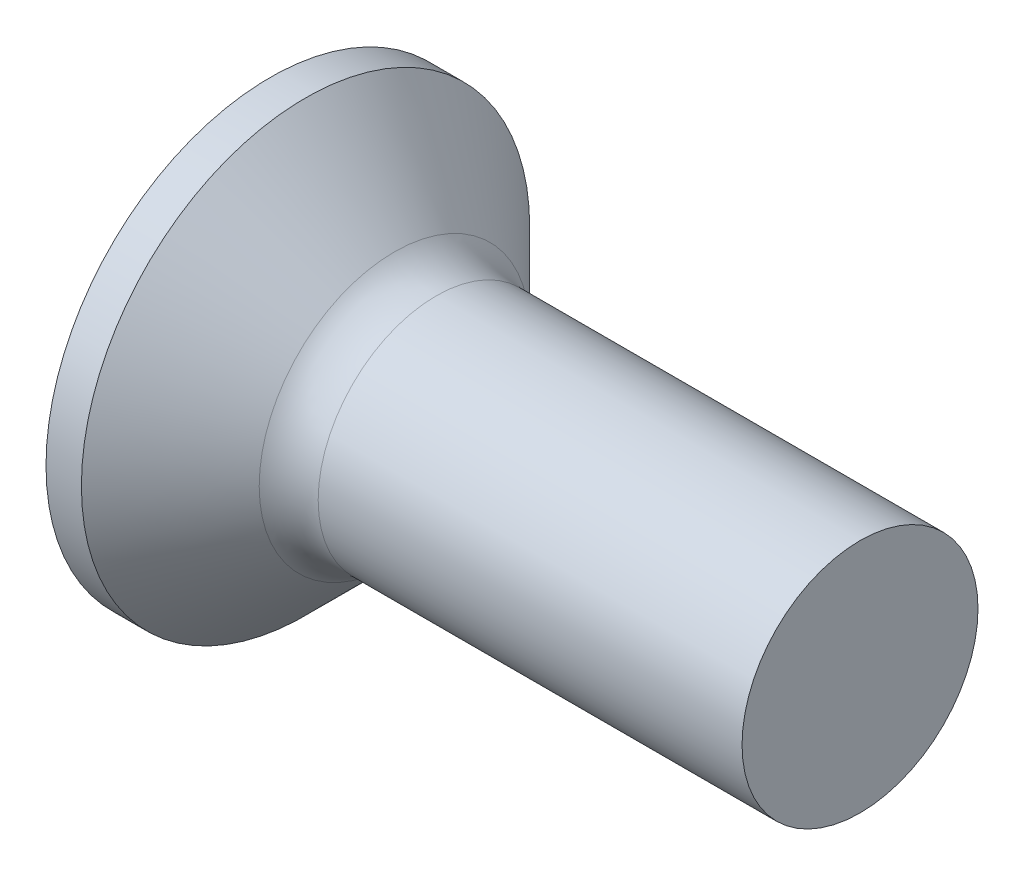
ISO-10303-21;
HEADER;
FILE_DESCRIPTION(('STEP AP214'),'2;1');
FILE_NAME('part.step','',(''),(''),'','','');
FILE_SCHEMA(('AUTOMOTIVE_DESIGN { 1 0 10303 214 1 1 1 1 }'));
ENDSEC;
DATA;
#1=APPLICATION_CONTEXT('core data for automotive mechanical design processes');
#2=APPLICATION_PROTOCOL_DEFINITION('international standard','automotive_design',2000,#1);
#3=PRODUCT_CONTEXT('',#1,'mechanical');
#4=PRODUCT('Part','Part','',(#3));
#5=PRODUCT_RELATED_PRODUCT_CATEGORY('part','',(#4));
#6=PRODUCT_DEFINITION_FORMATION('','',#4);
#7=PRODUCT_DEFINITION_CONTEXT('part definition',#1,'design');
#8=PRODUCT_DEFINITION('design','',#6,#7);
#9=PRODUCT_DEFINITION_SHAPE('','',#8);
#10=(LENGTH_UNIT() NAMED_UNIT(*) SI_UNIT(.MILLI.,.METRE.));
#11=(NAMED_UNIT(*) PLANE_ANGLE_UNIT() SI_UNIT($,.RADIAN.));
#12=(NAMED_UNIT(*) SI_UNIT($,.STERADIAN.) SOLID_ANGLE_UNIT());
#13=UNCERTAINTY_MEASURE_WITH_UNIT(LENGTH_MEASURE(1.E-05),#10,'distance_accuracy_value','');
#14=(GEOMETRIC_REPRESENTATION_CONTEXT(3) GLOBAL_UNCERTAINTY_ASSIGNED_CONTEXT((#13)) GLOBAL_UNIT_ASSIGNED_CONTEXT((#10,
#11,#12)) REPRESENTATION_CONTEXT('',''));
#15=CARTESIAN_POINT('',(0.,0.,0.));
#16=DIRECTION('',(0.,0.,1.));
#17=DIRECTION('',(1.,0.,0.));
#18=AXIS2_PLACEMENT_3D('',#15,#16,#17);
#19=CARTESIAN_POINT('',(0.,0.,0.));
#20=DIRECTION('',(-1.,0.,0.));
#21=DIRECTION('',(0.,0.,1.));
#22=AXIS2_PLACEMENT_3D('',#19,#20,#21);
#23=PLANE('',#22);
#24=CARTESIAN_POINT('',(0.,0.,0.));
#25=DIRECTION('',(-1.,0.,0.));
#26=DIRECTION('',(0.,0.,1.));
#27=AXIS2_PLACEMENT_3D('',#24,#25,#26);
#28=CIRCLE('',#27,1.9);
#29=CARTESIAN_POINT('',(0.,0.,1.9));
#30=VERTEX_POINT('',#29);
#31=EDGE_CURVE('E345',#30,#30,#28,.T.);
#32=ORIENTED_EDGE('',*,*,#31,.T.);
#33=EDGE_LOOP('',(#32));
#34=FACE_BOUND('',#33,.T.);
#35=DIRECTION('',(0.,0.,-1.));
#36=VECTOR('',#35,1.);
#37=CARTESIAN_POINT('',(0.,-0.240000000000003,0.949999999999999));
#38=LINE('',#37,#36);
#39=CARTESIAN_POINT('',(0.,-0.240000000000003,0.949999999999999));
#40=VERTEX_POINT('',#39);
#41=CARTESIAN_POINT('',(0.,-0.240000000000001,0.368080234393744));
#42=VERTEX_POINT('',#41);
#43=EDGE_CURVE('E384',#40,#42,#38,.T.);
#44=ORIENTED_EDGE('',*,*,#43,.T.);
#45=CARTESIAN_POINT('',(0.,0.,0.));
#46=DIRECTION('',(-1.,0.,0.));
#47=DIRECTION('',(0.,0.,1.));
#48=AXIS2_PLACEMENT_3D('',#45,#46,#47);
#49=CIRCLE('',#48,0.439412174332203);
#50=CARTESIAN_POINT('',(0.,-0.368080234393745,0.24));
#51=VERTEX_POINT('',#50);
#52=EDGE_CURVE('E372',#51,#42,#49,.T.);
#53=ORIENTED_EDGE('',*,*,#52,.F.);
#54=DIRECTION('',(0.,-1.,0.));
#55=VECTOR('',#54,1.);
#56=CARTESIAN_POINT('',(0.,0.95,0.24));
#57=LINE('',#56,#55);
#58=CARTESIAN_POINT('',(0.,-0.95,0.24));
#59=VERTEX_POINT('',#58);
#60=EDGE_CURVE('E431',#51,#59,#57,.T.);
#61=ORIENTED_EDGE('',*,*,#60,.T.);
#62=DIRECTION('',(0.,0.,-1.));
#63=VECTOR('',#62,1.);
#64=CARTESIAN_POINT('',(0.,-0.95,0.24));
#65=LINE('',#64,#63);
#66=CARTESIAN_POINT('',(0.,-0.95,-0.24));
#67=VERTEX_POINT('',#66);
#68=EDGE_CURVE('E342',#59,#67,#65,.T.);
#69=ORIENTED_EDGE('',*,*,#68,.T.);
#70=DIRECTION('',(0.,1.,0.));
#71=VECTOR('',#70,1.);
#72=CARTESIAN_POINT('',(0.,-0.95,-0.24));
#73=LINE('',#72,#71);
#74=CARTESIAN_POINT('',(0.,-0.368080234393745,-0.24));
#75=VERTEX_POINT('',#74);
#76=EDGE_CURVE('E432',#67,#75,#73,.T.);
#77=ORIENTED_EDGE('',*,*,#76,.T.);
#78=CARTESIAN_POINT('',(0.,-0.239999999999999,-0.368080234393746));
#79=VERTEX_POINT('',#78);
#80=EDGE_CURVE('E378',#79,#75,#49,.T.);
#81=ORIENTED_EDGE('',*,*,#80,.F.);
#82=CARTESIAN_POINT('',(0.,-0.239999999999997,-0.950000000000001));
#83=VERTEX_POINT('',#82);
#84=EDGE_CURVE('E393',#79,#83,#38,.T.);
#85=ORIENTED_EDGE('',*,*,#84,.T.);
#86=DIRECTION('',(0.,1.,0.));
#87=VECTOR('',#86,1.);
#88=CARTESIAN_POINT('',(0.,-0.239999999999997,-0.950000000000001));
#89=LINE('',#88,#87);
#90=CARTESIAN_POINT('',(0.,0.240000000000003,-0.949999999999999));
#91=VERTEX_POINT('',#90);
#92=EDGE_CURVE('E392',#83,#91,#89,.T.);
#93=ORIENTED_EDGE('',*,*,#92,.T.);
#94=DIRECTION('',(0.,0.,1.));
#95=VECTOR('',#94,1.);
#96=CARTESIAN_POINT('',(0.,0.240000000000003,-0.949999999999999));
#97=LINE('',#96,#95);
#98=CARTESIAN_POINT('',(0.,0.240000000000001,-0.368080234393745));
#99=VERTEX_POINT('',#98);
#100=EDGE_CURVE('E399',#91,#99,#97,.T.);
#101=ORIENTED_EDGE('',*,*,#100,.T.);
#102=CARTESIAN_POINT('',(0.,0.368080234393745,-0.24));
#103=VERTEX_POINT('',#102);
#104=EDGE_CURVE('E466',#103,#99,#49,.T.);
#105=ORIENTED_EDGE('',*,*,#104,.F.);
#106=CARTESIAN_POINT('',(0.,0.95,-0.24));
#107=VERTEX_POINT('',#106);
#108=EDGE_CURVE('E440',#103,#107,#73,.T.);
#109=ORIENTED_EDGE('',*,*,#108,.T.);
#110=DIRECTION('',(0.,0.,1.));
#111=VECTOR('',#110,1.);
#112=CARTESIAN_POINT('',(0.,0.95,-0.24));
#113=LINE('',#112,#111);
#114=CARTESIAN_POINT('',(0.,0.95,0.24));
#115=VERTEX_POINT('',#114);
#116=EDGE_CURVE('E428',#107,#115,#113,.T.);
#117=ORIENTED_EDGE('',*,*,#116,.T.);
#118=CARTESIAN_POINT('',(0.,0.368080234393745,0.24));
#119=VERTEX_POINT('',#118);
#120=EDGE_CURVE('E433',#115,#119,#57,.T.);
#121=ORIENTED_EDGE('',*,*,#120,.T.);
#122=CARTESIAN_POINT('',(0.,0.239999999999998,0.368080234393746));
#123=VERTEX_POINT('',#122);
#124=EDGE_CURVE('E380',#123,#119,#49,.T.);
#125=ORIENTED_EDGE('',*,*,#124,.F.);
#126=CARTESIAN_POINT('',(0.,0.239999999999996,0.950000000000001));
#127=VERTEX_POINT('',#126);
#128=EDGE_CURVE('E402',#123,#127,#97,.T.);
#129=ORIENTED_EDGE('',*,*,#128,.T.);
#130=DIRECTION('',(0.,-1.,0.));
#131=VECTOR('',#130,1.);
#132=CARTESIAN_POINT('',(0.,0.239999999999996,0.950000000000001));
#133=LINE('',#132,#131);
#134=EDGE_CURVE('E391',#127,#40,#133,.T.);
#135=ORIENTED_EDGE('',*,*,#134,.T.);
#136=EDGE_LOOP('',(#44,#53,#61,#69,#77,#81,#85,#93,#101,#105,#109,#117,#121,#125,#129,#135));
#137=FACE_BOUND('',#136,.T.);
#138=ADVANCED_FACE('F34',(#34,#137),#23,.T.);
#139=CARTESIAN_POINT('',(1.2,-0.351702090980209,0.24));
#140=DIRECTION('',(0.,0.,-1.));
#141=DIRECTION('',(-1.,0.,0.));
#142=AXIS2_PLACEMENT_3D('',#139,#140,#141);
#143=PLANE('',#142);
#144=ORIENTED_EDGE('',*,*,#60,.F.);
#145=CARTESIAN_POINT('',(-0.647693210421637,-0.421114336989891,0.24));
#146=CARTESIAN_POINT('',(-0.514503449539821,-0.410390261082994,0.24));
#147=CARTESIAN_POINT('',(-0.381320940230654,-0.399574318210381,0.24));
#148=CARTESIAN_POINT('',(-0.114973765657541,-0.377686644384344,0.24));
#149=CARTESIAN_POINT('',(0.0181908991048063,-0.366614907333784,0.24));
#150=CARTESIAN_POINT('',(0.284492634007954,-0.344144100394554,0.24));
#151=CARTESIAN_POINT('',(0.417629704159725,-0.332745030636282,0.24));
#152=CARTESIAN_POINT('',(0.683863247577946,-0.309504122508031,0.24));
#153=CARTESIAN_POINT('',(0.816959721458451,-0.297662291208049,0.24));
#154=CARTESIAN_POINT('',(1.04303435438055,-0.277010154534467,0.24));
#155=CARTESIAN_POINT('',(1.13602713245195,-0.268360479226192,0.24));
#156=CARTESIAN_POINT('',(1.32197255819723,-0.250648380041589,0.24));
#157=CARTESIAN_POINT('',(1.41492520622595,-0.241585959893611,0.24));
#158=CARTESIAN_POINT('',(1.60078125425266,-0.222904447218473,0.24));
#159=CARTESIAN_POINT('',(1.69368465086432,-0.213285320435301,0.24));
#160=CARTESIAN_POINT('',(1.87939874419459,-0.193166747195665,0.24));
#161=CARTESIAN_POINT('',(1.97220943766423,-0.182667270910301,0.24));
#162=CARTESIAN_POINT('',(2.0649517678624,-0.171565852393331,0.24));
#163=B_SPLINE_CURVE_WITH_KNOTS('',3,(#145,#146,#147,#148,#149,#150,#151,#152,#153,#154,#155,
#156,#157,#158,#159,#160,#161,#162),.UNSPECIFIED.,.F.,.F.,(4,2,2,2,2,2,2,2,4),(0.,
0.400862588724007,0.801734742325293,1.2026067362345,1.60347233177046,1.88365413960954,
2.16383341704974,2.44402995322111,2.72423598713696),.UNSPECIFIED.);
#164=CARTESIAN_POINT('',(1.2,-0.262259890185288,0.240000000000001));
#165=VERTEX_POINT('',#164);
#166=EDGE_CURVE('E375',#51,#165,#163,.T.);
#167=ORIENTED_EDGE('',*,*,#166,.T.);
#168=DIRECTION('',(0.,-1.,0.));
#169=VECTOR('',#168,1.);
#170=CARTESIAN_POINT('',(1.2,0.351702090980209,0.24));
#171=LINE('',#170,#169);
#172=CARTESIAN_POINT('',(1.2,-0.351702090980209,0.24));
#173=VERTEX_POINT('',#172);
#174=EDGE_CURVE('E447',#165,#173,#171,.T.);
#175=ORIENTED_EDGE('',*,*,#174,.T.);
#176=DIRECTION('',(0.89493436774996,0.446197800778958,0.));
#177=VECTOR('',#176,1.);
#178=CARTESIAN_POINT('',(0.,-0.95,0.24));
#179=LINE('',#178,#177);
#180=EDGE_CURVE('E320',#59,#173,#179,.T.);
#181=ORIENTED_EDGE('',*,*,#180,.F.);
#182=EDGE_LOOP('',(#144,#167,#175,#181));
#183=FACE_BOUND('',#182,.T.);
#184=ADVANCED_FACE('F188',(#183),#143,.T.);
#185=CARTESIAN_POINT('',(1.2,0.351702090980209,0.24));
#186=VERTEX_POINT('',#185);
#187=CARTESIAN_POINT('',(1.2,0.262259890185288,0.240000000000001));
#188=VERTEX_POINT('',#187);
#189=EDGE_CURVE('E329',#186,#188,#171,.T.);
#190=ORIENTED_EDGE('',*,*,#189,.T.);
#191=CARTESIAN_POINT('',(-0.647693210421637,0.421114336989891,0.24));
#192=CARTESIAN_POINT('',(-0.514503449539821,0.410390261082994,0.24));
#193=CARTESIAN_POINT('',(-0.381320940230654,0.399574318210381,0.24));
#194=CARTESIAN_POINT('',(-0.114973765657541,0.377686644384344,0.24));
#195=CARTESIAN_POINT('',(0.0181908991048065,0.366614907333784,0.24));
#196=CARTESIAN_POINT('',(0.284492634007954,0.344144100394554,0.24));
#197=CARTESIAN_POINT('',(0.417629704159725,0.332745030636282,0.24));
#198=CARTESIAN_POINT('',(0.683863247577946,0.309504122508032,0.24));
#199=CARTESIAN_POINT('',(0.816959721458451,0.297662291208049,0.24));
#200=CARTESIAN_POINT('',(1.04303435438055,0.277010154534467,0.24));
#201=CARTESIAN_POINT('',(1.13602713245196,0.268360479226192,0.24));
#202=CARTESIAN_POINT('',(1.32197255819723,0.250648380041589,0.24));
#203=CARTESIAN_POINT('',(1.41492520622595,0.241585959893611,0.24));
#204=CARTESIAN_POINT('',(1.60078125425266,0.222904447218473,0.24));
#205=CARTESIAN_POINT('',(1.69368465086432,0.213285320435301,0.24));
#206=CARTESIAN_POINT('',(1.87939874419459,0.193166747195665,0.24));
#207=CARTESIAN_POINT('',(1.97220943766423,0.182667270910301,0.24));
#208=CARTESIAN_POINT('',(2.0649517678624,0.171565852393331,0.24));
#209=B_SPLINE_CURVE_WITH_KNOTS('',3,(#191,#192,#193,#194,#195,#196,#197,#198,#199,#200,#201,
#202,#203,#204,#205,#206,#207,#208),.UNSPECIFIED.,.F.,.F.,(4,2,2,2,2,2,2,2,4),(0.,
0.400862588724007,0.801734742325293,1.2026067362345,1.60347233177046,1.88365413960954,
2.16383341704974,2.44402995322111,2.72423598713696),.UNSPECIFIED.);
#210=EDGE_CURVE('E248',#188,#119,#209,.F.);
#211=ORIENTED_EDGE('',*,*,#210,.T.);
#212=ORIENTED_EDGE('',*,*,#120,.F.);
#213=DIRECTION('',(0.89493436774996,-0.446197800778958,0.));
#214=VECTOR('',#213,1.);
#215=CARTESIAN_POINT('',(0.,0.95,0.24));
#216=LINE('',#215,#214);
#217=EDGE_CURVE('E57',#115,#186,#216,.T.);
#218=ORIENTED_EDGE('',*,*,#217,.T.);
#219=EDGE_LOOP('',(#190,#211,#212,#218));
#220=FACE_BOUND('',#219,.T.);
#221=ADVANCED_FACE('F193',(#220),#143,.T.);
#222=CARTESIAN_POINT('',(1.2,0.351702090980209,-0.24));
#223=DIRECTION('',(0.,0.,1.));
#224=DIRECTION('',(1.,0.,0.));
#225=AXIS2_PLACEMENT_3D('',#222,#223,#224);
#226=PLANE('',#225);
#227=DIRECTION('',(0.,1.,0.));
#228=VECTOR('',#227,1.);
#229=CARTESIAN_POINT('',(1.2,-0.351702090980209,-0.24));
#230=LINE('',#229,#228);
#231=CARTESIAN_POINT('',(1.2,-0.351702090980209,-0.24));
#232=VERTEX_POINT('',#231);
#233=CARTESIAN_POINT('',(1.2,-0.262259890185288,-0.24));
#234=VERTEX_POINT('',#233);
#235=EDGE_CURVE('E333',#232,#234,#230,.T.);
#236=ORIENTED_EDGE('',*,*,#235,.T.);
#237=CARTESIAN_POINT('',(-0.647693210421637,-0.421114336989891,-0.239999999999999));
#238=CARTESIAN_POINT('',(-0.514503449539821,-0.410390261082994,-0.24));
#239=CARTESIAN_POINT('',(-0.381320940230654,-0.399574318210381,-0.24));
#240=CARTESIAN_POINT('',(-0.114973765657541,-0.377686644384344,-0.24));
#241=CARTESIAN_POINT('',(0.0181908991048066,-0.366614907333785,-0.24));
#242=CARTESIAN_POINT('',(0.284492634007954,-0.344144100394554,-0.24));
#243=CARTESIAN_POINT('',(0.417629704159725,-0.332745030636282,-0.24));
#244=CARTESIAN_POINT('',(0.683863247577946,-0.309504122508032,-0.24));
#245=CARTESIAN_POINT('',(0.816959721458451,-0.297662291208049,-0.24));
#246=CARTESIAN_POINT('',(1.04303435438055,-0.277010154534467,-0.24));
#247=CARTESIAN_POINT('',(1.13602713245196,-0.268360479226193,-0.24));
#248=CARTESIAN_POINT('',(1.32197255819723,-0.250648380041589,-0.24));
#249=CARTESIAN_POINT('',(1.41492520622595,-0.241585959893612,-0.24));
#250=CARTESIAN_POINT('',(1.60078125425266,-0.222904447218473,-0.24));
#251=CARTESIAN_POINT('',(1.69368465086432,-0.213285320435301,-0.24));
#252=CARTESIAN_POINT('',(1.87939874419459,-0.193166747195665,-0.24));
#253=CARTESIAN_POINT('',(1.97220943766423,-0.182667270910301,-0.24));
#254=CARTESIAN_POINT('',(2.0649517678624,-0.171565852393331,-0.24));
#255=B_SPLINE_CURVE_WITH_KNOTS('',3,(#237,#238,#239,#240,#241,#242,#243,#244,#245,#246,#247,
#248,#249,#250,#251,#252,#253,#254),.UNSPECIFIED.,.F.,.F.,(4,2,2,2,2,2,2,2,4),(0.,
0.400862588724007,0.801734742325293,1.2026067362345,1.60347233177046,1.88365413960954,
2.16383341704974,2.44402995322111,2.72423598713696),.UNSPECIFIED.);
#256=EDGE_CURVE('E242',#234,#75,#255,.F.);
#257=ORIENTED_EDGE('',*,*,#256,.T.);
#258=ORIENTED_EDGE('',*,*,#76,.F.);
#259=DIRECTION('',(0.89493436774996,0.446197800778958,0.));
#260=VECTOR('',#259,1.);
#261=CARTESIAN_POINT('',(0.,-0.95,-0.24));
#262=LINE('',#261,#260);
#263=EDGE_CURVE('E442',#67,#232,#262,.T.);
#264=ORIENTED_EDGE('',*,*,#263,.T.);
#265=EDGE_LOOP('',(#236,#257,#258,#264));
#266=FACE_BOUND('',#265,.T.);
#267=ADVANCED_FACE('F228',(#266),#226,.T.);
#268=ORIENTED_EDGE('',*,*,#108,.F.);
#269=CARTESIAN_POINT('',(-0.647693210421637,0.421114336989891,-0.239999999999999));
#270=CARTESIAN_POINT('',(-0.514503449539821,0.410390261082994,-0.24));
#271=CARTESIAN_POINT('',(-0.381320940230654,0.399574318210381,-0.24));
#272=CARTESIAN_POINT('',(-0.114973765657541,0.377686644384344,-0.24));
#273=CARTESIAN_POINT('',(0.0181908991048066,0.366614907333785,-0.24));
#274=CARTESIAN_POINT('',(0.284492634007954,0.344144100394554,-0.24));
#275=CARTESIAN_POINT('',(0.417629704159725,0.332745030636282,-0.24));
#276=CARTESIAN_POINT('',(0.683863247577946,0.309504122508032,-0.24));
#277=CARTESIAN_POINT('',(0.816959721458451,0.297662291208049,-0.24));
#278=CARTESIAN_POINT('',(1.04303435438055,0.277010154534467,-0.24));
#279=CARTESIAN_POINT('',(1.13602713245196,0.268360479226193,-0.24));
#280=CARTESIAN_POINT('',(1.32197255819723,0.250648380041589,-0.24));
#281=CARTESIAN_POINT('',(1.41492520622595,0.241585959893612,-0.24));
#282=CARTESIAN_POINT('',(1.60078125425266,0.222904447218473,-0.24));
#283=CARTESIAN_POINT('',(1.69368465086432,0.213285320435301,-0.24));
#284=CARTESIAN_POINT('',(1.87939874419459,0.193166747195665,-0.24));
#285=CARTESIAN_POINT('',(1.97220943766423,0.182667270910302,-0.24));
#286=CARTESIAN_POINT('',(2.0649517678624,0.171565852393331,-0.24));
#287=B_SPLINE_CURVE_WITH_KNOTS('',3,(#269,#270,#271,#272,#273,#274,#275,#276,#277,#278,#279,
#280,#281,#282,#283,#284,#285,#286),.UNSPECIFIED.,.F.,.F.,(4,2,2,2,2,2,2,2,4),(0.,
0.400862588724007,0.801734742325293,1.2026067362345,1.60347233177046,1.88365413960954,
2.16383341704974,2.44402995322111,2.72423598713696),.UNSPECIFIED.);
#288=CARTESIAN_POINT('',(1.2,0.262259890185288,-0.24));
#289=VERTEX_POINT('',#288);
#290=EDGE_CURVE('E236',#103,#289,#287,.T.);
#291=ORIENTED_EDGE('',*,*,#290,.T.);
#292=CARTESIAN_POINT('',(1.2,0.351702090980209,-0.24));
#293=VERTEX_POINT('',#292);
#294=EDGE_CURVE('E337',#289,#293,#230,.T.);
#295=ORIENTED_EDGE('',*,*,#294,.T.);
#296=DIRECTION('',(0.89493436774996,-0.446197800778958,0.));
#297=VECTOR('',#296,1.);
#298=CARTESIAN_POINT('',(0.,0.95,-0.24));
#299=LINE('',#298,#297);
#300=EDGE_CURVE('E324',#107,#293,#299,.T.);
#301=ORIENTED_EDGE('',*,*,#300,.F.);
#302=EDGE_LOOP('',(#268,#291,#295,#301));
#303=FACE_BOUND('',#302,.T.);
#304=ADVANCED_FACE('F220',(#303),#226,.T.);
#305=CARTESIAN_POINT('',(1.2,-0.351702090980209,-0.24));
#306=DIRECTION('',(-1.,0.,0.));
#307=DIRECTION('',(0.,0.,1.));
#308=AXIS2_PLACEMENT_3D('',#305,#306,#307);
#309=PLANE('',#308);
#310=DIRECTION('',(0.,-1.,0.));
#311=VECTOR('',#310,1.);
#312=CARTESIAN_POINT('',(1.2,0.239999999999999,0.35170209098021));
#313=LINE('',#312,#311);
#314=CARTESIAN_POINT('',(1.2,-0.051825565121353,0.351702090980209));
#315=VERTEX_POINT('',#314);
#316=CARTESIAN_POINT('',(1.2,-0.240000000000001,0.351702090980208));
#317=VERTEX_POINT('',#316);
#318=EDGE_CURVE('E419',#315,#317,#313,.T.);
#319=ORIENTED_EDGE('',*,*,#318,.F.);
#320=CARTESIAN_POINT('',(1.2,0.,0.));
#321=DIRECTION('',(-1.,0.,0.));
#322=DIRECTION('',(0.,0.,1.));
#323=AXIS2_PLACEMENT_3D('',#320,#321,#322);
#324=CIRCLE('',#323,0.355499999999999);
#325=CARTESIAN_POINT('',(1.2,-0.240000000000001,0.262259890185287));
#326=VERTEX_POINT('',#325);
#327=EDGE_CURVE('E49',#326,#315,#324,.T.);
#328=ORIENTED_EDGE('',*,*,#327,.F.);
#329=DIRECTION('',(0.,0.,-1.));
#330=VECTOR('',#329,1.);
#331=CARTESIAN_POINT('',(1.2,-0.240000000000001,0.351702090980208));
#332=LINE('',#331,#330);
#333=EDGE_CURVE('E387',#317,#326,#332,.T.);
#334=ORIENTED_EDGE('',*,*,#333,.F.);
#335=EDGE_LOOP('',(#319,#328,#334));
#336=FACE_BOUND('',#335,.T.);
#337=ADVANCED_FACE('F216',(#336),#309,.T.);
#338=ORIENTED_EDGE('',*,*,#174,.F.);
#339=CARTESIAN_POINT('',(1.2,-0.35170209098021,0.0518255651213549));
#340=VERTEX_POINT('',#339);
#341=EDGE_CURVE('E479',#340,#165,#324,.T.);
#342=ORIENTED_EDGE('',*,*,#341,.F.);
#343=DIRECTION('',(0.,0.,-1.));
#344=VECTOR('',#343,1.);
#345=CARTESIAN_POINT('',(1.2,-0.351702090980209,0.24));
#346=LINE('',#345,#344);
#347=EDGE_CURVE('E315',#173,#340,#346,.T.);
#348=ORIENTED_EDGE('',*,*,#347,.F.);
#349=EDGE_LOOP('',(#338,#342,#348));
#350=FACE_BOUND('',#349,.T.);
#351=ADVANCED_FACE('F219',(#350),#309,.T.);
#352=CARTESIAN_POINT('',(1.2,-0.35170209098021,-0.0518255651213549));
#353=VERTEX_POINT('',#352);
#354=EDGE_CURVE('E325',#353,#232,#346,.T.);
#355=ORIENTED_EDGE('',*,*,#354,.F.);
#356=EDGE_CURVE('E483',#234,#353,#324,.T.);
#357=ORIENTED_EDGE('',*,*,#356,.F.);
#358=ORIENTED_EDGE('',*,*,#235,.F.);
#359=EDGE_LOOP('',(#355,#357,#358));
#360=FACE_BOUND('',#359,.T.);
#361=ADVANCED_FACE('F518',(#360),#309,.T.);
#362=CARTESIAN_POINT('',(1.2,-0.239999999999999,-0.262259890185289));
#363=VERTEX_POINT('',#362);
#364=CARTESIAN_POINT('',(1.2,-0.239999999999999,-0.35170209098021));
#365=VERTEX_POINT('',#364);
#366=EDGE_CURVE('E418',#363,#365,#332,.T.);
#367=ORIENTED_EDGE('',*,*,#366,.F.);
#368=CARTESIAN_POINT('',(1.2,-0.0518255651213534,-0.35170209098021));
#369=VERTEX_POINT('',#368);
#370=EDGE_CURVE('E511',#369,#363,#324,.T.);
#371=ORIENTED_EDGE('',*,*,#370,.F.);
#372=DIRECTION('',(0.,1.,0.));
#373=VECTOR('',#372,1.);
#374=CARTESIAN_POINT('',(1.2,-0.239999999999999,-0.35170209098021));
#375=LINE('',#374,#373);
#376=EDGE_CURVE('E414',#365,#369,#375,.T.);
#377=ORIENTED_EDGE('',*,*,#376,.F.);
#378=EDGE_LOOP('',(#367,#371,#377));
#379=FACE_BOUND('',#378,.T.);
#380=ADVANCED_FACE('F520',(#379),#309,.T.);
#381=CARTESIAN_POINT('',(1.2,0.0518255651213558,-0.351702090980209));
#382=VERTEX_POINT('',#381);
#383=CARTESIAN_POINT('',(1.2,0.240000000000001,-0.351702090980209));
#384=VERTEX_POINT('',#383);
#385=EDGE_CURVE('E421',#382,#384,#375,.T.);
#386=ORIENTED_EDGE('',*,*,#385,.F.);
#387=CARTESIAN_POINT('',(1.2,0.240000000000001,-0.262259890185287));
#388=VERTEX_POINT('',#387);
#389=EDGE_CURVE('E505',#388,#382,#324,.T.);
#390=ORIENTED_EDGE('',*,*,#389,.F.);
#391=DIRECTION('',(0.,0.,1.));
#392=VECTOR('',#391,1.);
#393=CARTESIAN_POINT('',(1.2,0.240000000000001,-0.351702090980209));
#394=LINE('',#393,#392);
#395=EDGE_CURVE('E424',#384,#388,#394,.T.);
#396=ORIENTED_EDGE('',*,*,#395,.F.);
#397=EDGE_LOOP('',(#386,#390,#396));
#398=FACE_BOUND('',#397,.T.);
#399=ADVANCED_FACE('F525',(#398),#309,.T.);
#400=ORIENTED_EDGE('',*,*,#294,.F.);
#401=CARTESIAN_POINT('',(1.2,0.351702090980209,-0.0518255651213562));
#402=VERTEX_POINT('',#401);
#403=EDGE_CURVE('E464',#402,#289,#324,.T.);
#404=ORIENTED_EDGE('',*,*,#403,.F.);
#405=DIRECTION('',(0.,0.,1.));
#406=VECTOR('',#405,1.);
#407=CARTESIAN_POINT('',(1.2,0.351702090980209,-0.24));
#408=LINE('',#407,#406);
#409=EDGE_CURVE('E445',#293,#402,#408,.T.);
#410=ORIENTED_EDGE('',*,*,#409,.F.);
#411=EDGE_LOOP('',(#400,#404,#410));
#412=FACE_BOUND('',#411,.T.);
#413=ADVANCED_FACE('F501',(#412),#309,.T.);
#414=CARTESIAN_POINT('',(1.2,0.351702090980209,0.0518255651213561));
#415=VERTEX_POINT('',#414);
#416=EDGE_CURVE('E336',#415,#186,#408,.T.);
#417=ORIENTED_EDGE('',*,*,#416,.F.);
#418=EDGE_CURVE('E458',#188,#415,#324,.T.);
#419=ORIENTED_EDGE('',*,*,#418,.F.);
#420=ORIENTED_EDGE('',*,*,#189,.F.);
#421=EDGE_LOOP('',(#417,#419,#420));
#422=FACE_BOUND('',#421,.T.);
#423=ADVANCED_FACE('F309',(#422),#309,.T.);
#424=CARTESIAN_POINT('',(1.2,0.239999999999999,0.262259890185289));
#425=VERTEX_POINT('',#424);
#426=CARTESIAN_POINT('',(1.2,0.239999999999999,0.35170209098021));
#427=VERTEX_POINT('',#426);
#428=EDGE_CURVE('E427',#425,#427,#394,.T.);
#429=ORIENTED_EDGE('',*,*,#428,.F.);
#430=CARTESIAN_POINT('',(1.2,0.0518255651213545,0.35170209098021));
#431=VERTEX_POINT('',#430);
#432=EDGE_CURVE('E379',#431,#425,#324,.T.);
#433=ORIENTED_EDGE('',*,*,#432,.F.);
#434=EDGE_CURVE('E415',#427,#431,#313,.T.);
#435=ORIENTED_EDGE('',*,*,#434,.F.);
#436=EDGE_LOOP('',(#429,#433,#435));
#437=FACE_BOUND('',#436,.T.);
#438=ADVANCED_FACE('F222',(#437),#309,.T.);
#439=CARTESIAN_POINT('',(1.2,-0.351702090980209,-0.24));
#440=DIRECTION('',(-0.446197800778958,0.894934367749961,0.));
#441=DIRECTION('',(-0.89493436774996,-0.446197800778958,0.));
#442=AXIS2_PLACEMENT_3D('',#439,#440,#441);
#443=PLANE('',#442);
#444=ORIENTED_EDGE('',*,*,#347,.T.);
#445=CARTESIAN_POINT('',(1.81755030037573,-0.0438028797890923,0.));
#446=DIRECTION('',(-0.446197800778958,0.894934367749961,0.));
#447=DIRECTION('',(-0.89493436774996,-0.446197800778958,0.));
#448=AXIS2_PLACEMENT_3D('',#445,#446,#447);
#449=ELLIPSE('',#448,0.699951178008363,0.309229710740658);
#450=EDGE_CURVE('E316',#340,#353,#449,.F.);
#451=ORIENTED_EDGE('',*,*,#450,.T.);
#452=ORIENTED_EDGE('',*,*,#354,.T.);
#453=ORIENTED_EDGE('',*,*,#263,.F.);
#454=ORIENTED_EDGE('',*,*,#68,.F.);
#455=ORIENTED_EDGE('',*,*,#180,.T.);
#456=EDGE_LOOP('',(#444,#451,#452,#453,#454,#455));
#457=FACE_BOUND('',#456,.T.);
#458=ADVANCED_FACE('F227',(#457),#443,.T.);
#459=CARTESIAN_POINT('',(1.2,0.351702090980209,0.24));
#460=DIRECTION('',(-0.446197800778958,-0.89493436774996,0.));
#461=DIRECTION('',(0.89493436774996,-0.446197800778958,0.));
#462=AXIS2_PLACEMENT_3D('',#459,#460,#461);
#463=PLANE('',#462);
#464=ORIENTED_EDGE('',*,*,#409,.T.);
#465=CARTESIAN_POINT('',(1.81755030037572,0.0438028797890929,0.));
#466=DIRECTION('',(-0.446197800778958,-0.89493436774996,0.));
#467=DIRECTION('',(-0.89493436774996,0.446197800778958,0.));
#468=AXIS2_PLACEMENT_3D('',#465,#466,#467);
#469=ELLIPSE('',#468,0.699951178008361,0.309229710740658);
#470=EDGE_CURVE('E289',#402,#415,#469,.F.);
#471=ORIENTED_EDGE('',*,*,#470,.T.);
#472=ORIENTED_EDGE('',*,*,#416,.T.);
#473=ORIENTED_EDGE('',*,*,#217,.F.);
#474=ORIENTED_EDGE('',*,*,#116,.F.);
#475=ORIENTED_EDGE('',*,*,#300,.T.);
#476=EDGE_LOOP('',(#464,#471,#472,#473,#474,#475));
#477=FACE_BOUND('',#476,.T.);
#478=ADVANCED_FACE('F223',(#477),#463,.T.);
#479=CARTESIAN_POINT('',(1.2,-0.239999999999999,-0.35170209098021));
#480=DIRECTION('',(0.,1.,0.));
#481=DIRECTION('',(-1.,0.,0.));
#482=AXIS2_PLACEMENT_3D('',#479,#480,#481);
#483=PLANE('',#482);
#484=ORIENTED_EDGE('',*,*,#84,.F.);
#485=CARTESIAN_POINT('',(-0.647693210410766,-0.239999999999999,-0.421114336989017));
#486=CARTESIAN_POINT('',(-0.514503449530112,-0.239999999999999,-0.410390261082207));
#487=CARTESIAN_POINT('',(-0.381320940222106,-0.239999999999999,-0.399574318209684));
#488=CARTESIAN_POINT('',(-0.114973765651316,-0.239999999999999,-0.377686644383828));
#489=CARTESIAN_POINT('',(0.01819089910987,-0.239999999999999,-0.366614907333361));
#490=CARTESIAN_POINT('',(0.284492634009302,-0.239999999999999,-0.344144100394438));
#491=CARTESIAN_POINT('',(0.417629704158519,-0.239999999999999,-0.332745030636383));
#492=CARTESIAN_POINT('',(0.683863247571635,-0.239999999999999,-0.309504122508587));
#493=CARTESIAN_POINT('',(0.816959721449588,-0.239999999999999,-0.297662291208841));
#494=CARTESIAN_POINT('',(1.04303435436914,-0.239999999999999,-0.277010154535523));
#495=CARTESIAN_POINT('',(1.13602713244054,-0.239999999999999,-0.268360479227263));
#496=CARTESIAN_POINT('',(1.32197255818582,-0.239999999999999,-0.250648380042693));
#497=CARTESIAN_POINT('',(1.41492520621454,-0.239999999999999,-0.241585959894735));
#498=CARTESIAN_POINT('',(1.60078125424125,-0.239999999999999,-0.222904447219644));
#499=CARTESIAN_POINT('',(1.69368465085292,-0.239999999999999,-0.213285320436499));
#500=CARTESIAN_POINT('',(1.8793987441832,-0.24,-0.193166747196935));
#501=CARTESIAN_POINT('',(1.97220943765284,-0.24,-0.182667270911615));
#502=CARTESIAN_POINT('',(2.06495176785102,-0.24,-0.171565852394701));
#503=B_SPLINE_CURVE_WITH_KNOTS('',3,(#485,#486,#487,#488,#489,#490,#491,#492,#493,#494,#495,
#496,#497,#498,#499,#500,#501,#502),.UNSPECIFIED.,.F.,.F.,(4,2,2,2,2,2,2,2,4),(0.,
0.400862588720512,0.801734742318303,1.20260673621982,1.60347233174809,1.88365413958718,
2.16383341702737,2.44402995319874,2.72423598711459),.UNSPECIFIED.);
#504=EDGE_CURVE('E282',#79,#363,#503,.T.);
#505=ORIENTED_EDGE('',*,*,#504,.T.);
#506=ORIENTED_EDGE('',*,*,#366,.T.);
#507=DIRECTION('',(0.89493436774996,0.,0.446197800778958));
#508=VECTOR('',#507,1.);
#509=CARTESIAN_POINT('',(0.,-0.239999999999997,-0.950000000000001));
#510=LINE('',#509,#508);
#511=EDGE_CURVE('E403',#83,#365,#510,.T.);
#512=ORIENTED_EDGE('',*,*,#511,.F.);
#513=EDGE_LOOP('',(#484,#505,#506,#512));
#514=FACE_BOUND('',#513,.T.);
#515=ADVANCED_FACE('F226',(#514),#483,.T.);
#516=CARTESIAN_POINT('',(1.2,0.239999999999999,0.35170209098021));
#517=DIRECTION('',(0.,-1.,0.));
#518=DIRECTION('',(1.,0.,0.));
#519=AXIS2_PLACEMENT_3D('',#516,#517,#518);
#520=PLANE('',#519);
#521=ORIENTED_EDGE('',*,*,#395,.T.);
#522=CARTESIAN_POINT('',(-0.647693210421637,0.240000000000001,-0.42111433698989));
#523=CARTESIAN_POINT('',(-0.514503449539821,0.240000000000001,-0.410390261082993));
#524=CARTESIAN_POINT('',(-0.381320940230654,0.240000000000001,-0.399574318210381));
#525=CARTESIAN_POINT('',(-0.114973765657541,0.240000000000001,-0.377686644384343));
#526=CARTESIAN_POINT('',(0.0181908991048065,0.240000000000001,-0.366614907333784));
#527=CARTESIAN_POINT('',(0.284492634007954,0.240000000000001,-0.344144100394553));
#528=CARTESIAN_POINT('',(0.417629704159725,0.240000000000001,-0.332745030636281));
#529=CARTESIAN_POINT('',(0.683863247577946,0.240000000000001,-0.309504122508031));
#530=CARTESIAN_POINT('',(0.816959721458451,0.240000000000001,-0.297662291208048));
#531=CARTESIAN_POINT('',(1.04303435438055,0.240000000000001,-0.277010154534467));
#532=CARTESIAN_POINT('',(1.13602713245196,0.240000000000001,-0.268360479226192));
#533=CARTESIAN_POINT('',(1.32197255819723,0.240000000000001,-0.250648380041588));
#534=CARTESIAN_POINT('',(1.41492520622595,0.240000000000001,-0.241585959893611));
#535=CARTESIAN_POINT('',(1.60078125425266,0.240000000000001,-0.222904447218472));
#536=CARTESIAN_POINT('',(1.69368465086432,0.240000000000001,-0.2132853204353));
#537=CARTESIAN_POINT('',(1.87939874419459,0.240000000000001,-0.193166747195664));
#538=CARTESIAN_POINT('',(1.97220943766423,0.240000000000001,-0.182667270910301));
#539=CARTESIAN_POINT('',(2.0649517678624,0.240000000000001,-0.17156585239333));
#540=B_SPLINE_CURVE_WITH_KNOTS('',3,(#522,#523,#524,#525,#526,#527,#528,#529,#530,#531,#532,
#533,#534,#535,#536,#537,#538,#539),.UNSPECIFIED.,.F.,.F.,(4,2,2,2,2,2,2,2,4),(0.,
0.400862588724007,0.801734742325293,1.2026067362345,1.60347233177046,1.88365413960954,
2.16383341704974,2.44402995322111,2.72423598713696),.UNSPECIFIED.);
#541=EDGE_CURVE('E276',#388,#99,#540,.F.);
#542=ORIENTED_EDGE('',*,*,#541,.T.);
#543=ORIENTED_EDGE('',*,*,#100,.F.);
#544=DIRECTION('',(0.89493436774996,0.,0.446197800778958));
#545=VECTOR('',#544,1.);
#546=CARTESIAN_POINT('',(0.,0.240000000000003,-0.949999999999999));
#547=LINE('',#546,#545);
#548=EDGE_CURVE('E406',#91,#384,#547,.T.);
#549=ORIENTED_EDGE('',*,*,#548,.T.);
#550=EDGE_LOOP('',(#521,#542,#543,#549));
#551=FACE_BOUND('',#550,.T.);
#552=ADVANCED_FACE('F292',(#551),#520,.T.);
#553=CARTESIAN_POINT('',(1.2,0.240000000000001,-0.351702090980209));
#554=DIRECTION('',(-0.446197800778958,0.,0.894934367749961));
#555=DIRECTION('',(-0.89493436774996,0.,-0.446197800778958));
#556=AXIS2_PLACEMENT_3D('',#553,#554,#555);
#557=PLANE('',#556);
#558=ORIENTED_EDGE('',*,*,#376,.T.);
#559=CARTESIAN_POINT('',(1.81755030037573,0.,-0.0438028797890923));
#560=DIRECTION('',(-0.446197800778958,0.,0.894934367749961));
#561=DIRECTION('',(-0.89493436774996,0.,-0.446197800778958));
#562=AXIS2_PLACEMENT_3D('',#559,#560,#561);
#563=ELLIPSE('',#562,0.699951178008363,0.309229710740658);
#564=EDGE_CURVE('E388',#369,#382,#563,.F.);
#565=ORIENTED_EDGE('',*,*,#564,.T.);
#566=ORIENTED_EDGE('',*,*,#385,.T.);
#567=ORIENTED_EDGE('',*,*,#548,.F.);
#568=ORIENTED_EDGE('',*,*,#92,.F.);
#569=ORIENTED_EDGE('',*,*,#511,.T.);
#570=EDGE_LOOP('',(#558,#565,#566,#567,#568,#569));
#571=FACE_BOUND('',#570,.T.);
#572=ADVANCED_FACE('F255',(#571),#557,.T.);
#573=ORIENTED_EDGE('',*,*,#333,.T.);
#574=CARTESIAN_POINT('',(-0.647693210421637,-0.240000000000001,0.42111433698989));
#575=CARTESIAN_POINT('',(-0.514503449539821,-0.240000000000001,0.410390261082993));
#576=CARTESIAN_POINT('',(-0.381320940230654,-0.240000000000001,0.39957431821038));
#577=CARTESIAN_POINT('',(-0.114973765657541,-0.240000000000001,0.377686644384343));
#578=CARTESIAN_POINT('',(0.0181908991048062,-0.240000000000001,0.366614907333784));
#579=CARTESIAN_POINT('',(0.284492634007953,-0.240000000000001,0.344144100394553));
#580=CARTESIAN_POINT('',(0.417629704159725,-0.240000000000001,0.332745030636281));
#581=CARTESIAN_POINT('',(0.683863247577946,-0.240000000000001,0.309504122508031));
#582=CARTESIAN_POINT('',(0.816959721458451,-0.240000000000001,0.297662291208048));
#583=CARTESIAN_POINT('',(1.04303435438055,-0.240000000000001,0.277010154534466));
#584=CARTESIAN_POINT('',(1.13602713245196,-0.240000000000001,0.268360479226192));
#585=CARTESIAN_POINT('',(1.32197255819723,-0.240000000000001,0.250648380041588));
#586=CARTESIAN_POINT('',(1.41492520622595,-0.240000000000001,0.241585959893611));
#587=CARTESIAN_POINT('',(1.60078125425266,-0.240000000000001,0.222904447218472));
#588=CARTESIAN_POINT('',(1.69368465086432,-0.240000000000001,0.2132853204353));
#589=CARTESIAN_POINT('',(1.87939874419459,-0.240000000000001,0.193166747195664));
#590=CARTESIAN_POINT('',(1.97220943766423,-0.240000000000001,0.182667270910301));
#591=CARTESIAN_POINT('',(2.0649517678624,-0.240000000000001,0.171565852393331));
#592=B_SPLINE_CURVE_WITH_KNOTS('',3,(#574,#575,#576,#577,#578,#579,#580,#581,#582,#583,#584,
#585,#586,#587,#588,#589,#590,#591),.UNSPECIFIED.,.F.,.F.,(4,2,2,2,2,2,2,2,4),(0.,
0.400862588724007,0.801734742325293,1.2026067362345,1.60347233177046,1.88365413960954,
2.16383341704974,2.44402995322111,2.72423598713696),.UNSPECIFIED.);
#593=EDGE_CURVE('E269',#326,#42,#592,.F.);
#594=ORIENTED_EDGE('',*,*,#593,.T.);
#595=ORIENTED_EDGE('',*,*,#43,.F.);
#596=DIRECTION('',(0.89493436774996,0.,-0.446197800778958));
#597=VECTOR('',#596,1.);
#598=CARTESIAN_POINT('',(0.,-0.240000000000003,0.949999999999999));
#599=LINE('',#598,#597);
#600=EDGE_CURVE('E409',#40,#317,#599,.T.);
#601=ORIENTED_EDGE('',*,*,#600,.T.);
#602=EDGE_LOOP('',(#573,#594,#595,#601));
#603=FACE_BOUND('',#602,.T.);
#604=ADVANCED_FACE('F294',(#603),#483,.T.);
#605=ORIENTED_EDGE('',*,*,#128,.F.);
#606=CARTESIAN_POINT('',(-0.647693210410766,0.239999999999998,0.421114336989017));
#607=CARTESIAN_POINT('',(-0.514503449530112,0.239999999999998,0.410390261082208));
#608=CARTESIAN_POINT('',(-0.381320940222106,0.239999999999998,0.399574318209684));
#609=CARTESIAN_POINT('',(-0.114973765651316,0.239999999999998,0.377686644383829));
#610=CARTESIAN_POINT('',(0.0181908991098697,0.239999999999998,0.366614907333361));
#611=CARTESIAN_POINT('',(0.284492634009302,0.239999999999999,0.344144100394438));
#612=CARTESIAN_POINT('',(0.417629704158519,0.239999999999999,0.332745030636384));
#613=CARTESIAN_POINT('',(0.683863247571635,0.239999999999999,0.309504122508588));
#614=CARTESIAN_POINT('',(0.816959721449588,0.239999999999999,0.297662291208841));
#615=CARTESIAN_POINT('',(1.04303435436914,0.239999999999999,0.277010154535524));
#616=CARTESIAN_POINT('',(1.13602713244054,0.239999999999999,0.268360479227263));
#617=CARTESIAN_POINT('',(1.32197255818582,0.239999999999999,0.250648380042694));
#618=CARTESIAN_POINT('',(1.41492520621454,0.239999999999999,0.241585959894736));
#619=CARTESIAN_POINT('',(1.60078125424125,0.239999999999999,0.222904447219644));
#620=CARTESIAN_POINT('',(1.69368465085292,0.239999999999999,0.213285320436499));
#621=CARTESIAN_POINT('',(1.8793987441832,0.239999999999999,0.193166747196935));
#622=CARTESIAN_POINT('',(1.97220943765284,0.24,0.182667270911615));
#623=CARTESIAN_POINT('',(2.06495176785102,0.24,0.171565852394701));
#624=B_SPLINE_CURVE_WITH_KNOTS('',3,(#606,#607,#608,#609,#610,#611,#612,#613,#614,#615,#616,
#617,#618,#619,#620,#621,#622,#623),.UNSPECIFIED.,.F.,.F.,(4,2,2,2,2,2,2,2,4),(0.,
0.400862588720512,0.801734742318303,1.20260673621982,1.60347233174809,1.88365413958718,
2.16383341702737,2.44402995319874,2.72423598711459),.UNSPECIFIED.);
#625=EDGE_CURVE('E260',#123,#425,#624,.T.);
#626=ORIENTED_EDGE('',*,*,#625,.T.);
#627=ORIENTED_EDGE('',*,*,#428,.T.);
#628=DIRECTION('',(0.89493436774996,0.,-0.446197800778958));
#629=VECTOR('',#628,1.);
#630=CARTESIAN_POINT('',(0.,0.239999999999996,0.950000000000001));
#631=LINE('',#630,#629);
#632=EDGE_CURVE('E411',#127,#427,#631,.T.);
#633=ORIENTED_EDGE('',*,*,#632,.F.);
#634=EDGE_LOOP('',(#605,#626,#627,#633));
#635=FACE_BOUND('',#634,.T.);
#636=ADVANCED_FACE('F300',(#635),#520,.T.);
#637=CARTESIAN_POINT('',(1.2,-0.240000000000001,0.351702090980208));
#638=DIRECTION('',(-0.446197800778958,0.,-0.89493436774996));
#639=DIRECTION('',(0.89493436774996,0.,-0.446197800778958));
#640=AXIS2_PLACEMENT_3D('',#637,#638,#639);
#641=PLANE('',#640);
#642=ORIENTED_EDGE('',*,*,#434,.T.);
#643=CARTESIAN_POINT('',(1.81755030037572,0.,0.0438028797890929));
#644=DIRECTION('',(-0.446197800778958,0.,-0.89493436774996));
#645=DIRECTION('',(-0.89493436774996,0.,0.446197800778958));
#646=AXIS2_PLACEMENT_3D('',#643,#644,#645);
#647=ELLIPSE('',#646,0.699951178008361,0.309229710740658);
#648=EDGE_CURVE('E11',#431,#315,#647,.F.);
#649=ORIENTED_EDGE('',*,*,#648,.T.);
#650=ORIENTED_EDGE('',*,*,#318,.T.);
#651=ORIENTED_EDGE('',*,*,#600,.F.);
#652=ORIENTED_EDGE('',*,*,#134,.F.);
#653=ORIENTED_EDGE('',*,*,#632,.T.);
#654=EDGE_LOOP('',(#642,#649,#650,#651,#652,#653));
#655=FACE_BOUND('',#654,.T.);
#656=ADVANCED_FACE('F203',(#655),#641,.T.);
#657=CARTESIAN_POINT('',(-6.34999999999999,0.,0.));
#658=DIRECTION('',(-1.,0.,0.));
#659=DIRECTION('',(0.,0.,1.));
#660=AXIS2_PLACEMENT_3D('',#657,#658,#659);
#661=CYLINDRICAL_SURFACE('',#660,1.9);
#662=CARTESIAN_POINT('',(0.300000000000004,0.,0.));
#663=DIRECTION('',(-1.,0.,0.));
#664=DIRECTION('',(0.,0.,1.));
#665=AXIS2_PLACEMENT_3D('',#662,#663,#664);
#666=CIRCLE('',#665,1.9);
#667=CARTESIAN_POINT('',(0.300000000000004,0.,1.9));
#668=VERTEX_POINT('',#667);
#669=EDGE_CURVE('E341',#668,#668,#666,.T.);
#670=ORIENTED_EDGE('',*,*,#669,.T.);
#671=EDGE_LOOP('',(#670));
#672=FACE_BOUND('',#671,.T.);
#673=ORIENTED_EDGE('',*,*,#31,.F.);
#674=EDGE_LOOP('',(#673));
#675=FACE_BOUND('',#674,.T.);
#676=ADVANCED_FACE('F199',(#672,#675),#661,.T.);
#677=CARTESIAN_POINT('',(0.300000000000004,0.,0.));
#678=DIRECTION('',(-1.,0.,0.));
#679=DIRECTION('',(0.,0.,1.));
#680=AXIS2_PLACEMENT_3D('',#677,#678,#679);
#681=CONICAL_SURFACE('',#680,1.9,0.785398163397451);
#682=CARTESIAN_POINT('',(1.05355339059327,0.,0.));
#683=DIRECTION('',(-1.,0.,0.));
#684=DIRECTION('',(0.,0.,1.));
#685=AXIS2_PLACEMENT_3D('',#682,#683,#684);
#686=CIRCLE('',#685,1.14644660940673);
#687=CARTESIAN_POINT('',(1.05355339059327,0.,1.14644660940673));
#688=VERTEX_POINT('',#687);
#689=EDGE_CURVE('E347',#688,#688,#686,.T.);
#690=ORIENTED_EDGE('',*,*,#689,.T.);
#691=EDGE_LOOP('',(#690));
#692=FACE_BOUND('',#691,.T.);
#693=ORIENTED_EDGE('',*,*,#669,.F.);
#694=EDGE_LOOP('',(#693));
#695=FACE_BOUND('',#694,.T.);
#696=ADVANCED_FACE('F202',(#692,#695),#681,.T.);
#697=CARTESIAN_POINT('',(-6.34999999999999,0.,0.));
#698=DIRECTION('',(-1.,0.,0.));
#699=DIRECTION('',(0.,0.,1.));
#700=AXIS2_PLACEMENT_3D('',#697,#698,#699);
#701=CYLINDRICAL_SURFACE('',#700,1.);
#702=CARTESIAN_POINT('',(1.40710678118655,0.,0.));
#703=DIRECTION('',(-1.,0.,0.));
#704=DIRECTION('',(0.,0.,1.));
#705=AXIS2_PLACEMENT_3D('',#702,#703,#704);
#706=CIRCLE('',#705,1.);
#707=CARTESIAN_POINT('',(1.40710678118655,0.,1.));
#708=VERTEX_POINT('',#707);
#709=EDGE_CURVE('E42',#708,#708,#706,.F.);
#710=ORIENTED_EDGE('',*,*,#709,.T.);
#711=EDGE_LOOP('',(#710));
#712=FACE_BOUND('',#711,.T.);
#713=CARTESIAN_POINT('',(5.,0.,0.));
#714=DIRECTION('',(-1.,0.,0.));
#715=DIRECTION('',(0.,0.,1.));
#716=AXIS2_PLACEMENT_3D('',#713,#714,#715);
#717=CIRCLE('',#716,1.);
#718=CARTESIAN_POINT('',(5.,0.,1.));
#719=VERTEX_POINT('',#718);
#720=EDGE_CURVE('E338',#719,#719,#717,.T.);
#721=ORIENTED_EDGE('',*,*,#720,.T.);
#722=EDGE_LOOP('',(#721));
#723=FACE_BOUND('',#722,.T.);
#724=ADVANCED_FACE('F207',(#712,#723),#701,.T.);
#725=CARTESIAN_POINT('',(5.,1.,0.));
#726=DIRECTION('',(1.,0.,0.));
#727=DIRECTION('',(0.,0.,-1.));
#728=AXIS2_PLACEMENT_3D('',#725,#726,#727);
#729=PLANE('',#728);
#730=ORIENTED_EDGE('',*,*,#720,.F.);
#731=EDGE_LOOP('',(#730));
#732=FACE_BOUND('',#731,.T.);
#733=ADVANCED_FACE('F211',(#732),#729,.T.);
#734=CARTESIAN_POINT('',(1.40710678118655,0.,0.));
#735=DIRECTION('',(-1.,0.,0.));
#736=DIRECTION('',(0.,0.,1.));
#737=AXIS2_PLACEMENT_3D('',#734,#735,#736);
#738=TOROIDAL_SURFACE('',#737,1.5,0.5);
#739=ORIENTED_EDGE('',*,*,#709,.F.);
#740=EDGE_LOOP('',(#739));
#741=FACE_BOUND('',#740,.T.);
#742=ORIENTED_EDGE('',*,*,#689,.F.);
#743=EDGE_LOOP('',(#742));
#744=FACE_BOUND('',#743,.T.);
#745=ADVANCED_FACE('F36',(#741,#744),#738,.F.);
#746=CARTESIAN_POINT('',(1.2,0.,0.));
#747=DIRECTION('',(-1.,0.,0.));
#748=DIRECTION('',(0.,0.,1.));
#749=AXIS2_PLACEMENT_3D('',#746,#747,#748);
#750=CONICAL_SURFACE('',#749,0.355499999999999,0.069813170079766);
#751=ORIENTED_EDGE('',*,*,#52,.T.);
#752=ORIENTED_EDGE('',*,*,#593,.F.);
#753=EDGE_CURVE('E482',#165,#326,#324,.T.);
#754=ORIENTED_EDGE('',*,*,#753,.F.);
#755=ORIENTED_EDGE('',*,*,#166,.F.);
#756=EDGE_LOOP('',(#751,#752,#754,#755));
#757=FACE_BOUND('',#756,.T.);
#758=ADVANCED_FACE('F185',(#757),#750,.F.);
#759=EDGE_CURVE('E461',#425,#188,#324,.T.);
#760=ORIENTED_EDGE('',*,*,#759,.F.);
#761=ORIENTED_EDGE('',*,*,#625,.F.);
#762=ORIENTED_EDGE('',*,*,#124,.T.);
#763=ORIENTED_EDGE('',*,*,#210,.F.);
#764=EDGE_LOOP('',(#760,#761,#762,#763));
#765=FACE_BOUND('',#764,.T.);
#766=ADVANCED_FACE('F364',(#765),#750,.F.);
#767=EDGE_CURVE('E514',#363,#234,#324,.T.);
#768=ORIENTED_EDGE('',*,*,#767,.F.);
#769=ORIENTED_EDGE('',*,*,#504,.F.);
#770=ORIENTED_EDGE('',*,*,#80,.T.);
#771=ORIENTED_EDGE('',*,*,#256,.F.);
#772=EDGE_LOOP('',(#768,#769,#770,#771));
#773=FACE_BOUND('',#772,.T.);
#774=ADVANCED_FACE('F369',(#773),#750,.F.);
#775=ORIENTED_EDGE('',*,*,#104,.T.);
#776=ORIENTED_EDGE('',*,*,#541,.F.);
#777=EDGE_CURVE('E504',#289,#388,#324,.T.);
#778=ORIENTED_EDGE('',*,*,#777,.F.);
#779=ORIENTED_EDGE('',*,*,#290,.F.);
#780=EDGE_LOOP('',(#775,#776,#778,#779));
#781=FACE_BOUND('',#780,.T.);
#782=ADVANCED_FACE('F710',(#781),#750,.F.);
#783=EDGE_CURVE('E481',#353,#340,#324,.T.);
#784=ORIENTED_EDGE('',*,*,#783,.F.);
#785=ORIENTED_EDGE('',*,*,#450,.F.);
#786=EDGE_LOOP('',(#784,#785));
#787=FACE_BOUND('',#786,.T.);
#788=ADVANCED_FACE('F712',(#787),#750,.F.);
#789=EDGE_CURVE('E462',#415,#402,#324,.T.);
#790=ORIENTED_EDGE('',*,*,#789,.F.);
#791=ORIENTED_EDGE('',*,*,#470,.F.);
#792=EDGE_LOOP('',(#790,#791));
#793=FACE_BOUND('',#792,.T.);
#794=ADVANCED_FACE('F717',(#793),#750,.F.);
#795=EDGE_CURVE('E508',#382,#369,#324,.T.);
#796=ORIENTED_EDGE('',*,*,#795,.F.);
#797=ORIENTED_EDGE('',*,*,#564,.F.);
#798=EDGE_LOOP('',(#796,#797));
#799=FACE_BOUND('',#798,.T.);
#800=ADVANCED_FACE('F182',(#799),#750,.F.);
#801=EDGE_CURVE('E465',#315,#431,#324,.T.);
#802=ORIENTED_EDGE('',*,*,#801,.F.);
#803=ORIENTED_EDGE('',*,*,#648,.F.);
#804=EDGE_LOOP('',(#802,#803));
#805=FACE_BOUND('',#804,.T.);
#806=ADVANCED_FACE('F177',(#805),#750,.F.);
#807=CARTESIAN_POINT('',(1.31550895201079,0.,0.));
#808=DIRECTION('',(-1.,0.,0.));
#809=DIRECTION('',(0.,0.,1.));
#810=AXIS2_PLACEMENT_3D('',#807,#808,#809);
#811=CONICAL_SURFACE('',#810,0.,1.25663706143592);
#812=ORIENTED_EDGE('',*,*,#432,.T.);
#813=ORIENTED_EDGE('',*,*,#759,.T.);
#814=ORIENTED_EDGE('',*,*,#418,.T.);
#815=ORIENTED_EDGE('',*,*,#789,.T.);
#816=ORIENTED_EDGE('',*,*,#403,.T.);
#817=ORIENTED_EDGE('',*,*,#777,.T.);
#818=ORIENTED_EDGE('',*,*,#389,.T.);
#819=ORIENTED_EDGE('',*,*,#795,.T.);
#820=ORIENTED_EDGE('',*,*,#370,.T.);
#821=ORIENTED_EDGE('',*,*,#767,.T.);
#822=ORIENTED_EDGE('',*,*,#356,.T.);
#823=ORIENTED_EDGE('',*,*,#783,.T.);
#824=ORIENTED_EDGE('',*,*,#341,.T.);
#825=ORIENTED_EDGE('',*,*,#753,.T.);
#826=ORIENTED_EDGE('',*,*,#327,.T.);
#827=ORIENTED_EDGE('',*,*,#801,.T.);
#828=EDGE_LOOP('',(#812,#813,#814,#815,#816,#817,#818,#819,#820,#821,#822,#823,#824,#825,#826,#827));
#829=FACE_BOUND('',#828,.T.);
#830=CARTESIAN_POINT('',(1.31550895201079,0.,0.));
#831=VERTEX_POINT('',#830);
#832=VERTEX_LOOP('',#831);
#833=FACE_BOUND('',#832,.T.);
#834=ADVANCED_FACE('F175',(#829,#833),#811,.F.);
#835=CLOSED_SHELL('',(#138,#184,#221,#267,#304,#337,#351,#361,#380,#399,#413,#423,#438,#458,
#478,#515,#552,#572,#604,#636,#656,#676,#696,#724,#733,#745,#758,#766,#774,#782,#788,#794,#800,
#806,#834));
#836=MANIFOLD_SOLID_BREP('B2',#835);
#837=ADVANCED_BREP_SHAPE_REPRESENTATION('',(#18,#836),#14);
#838=SHAPE_DEFINITION_REPRESENTATION(#9,#837);
ENDSEC;
END-ISO-10303-21;
